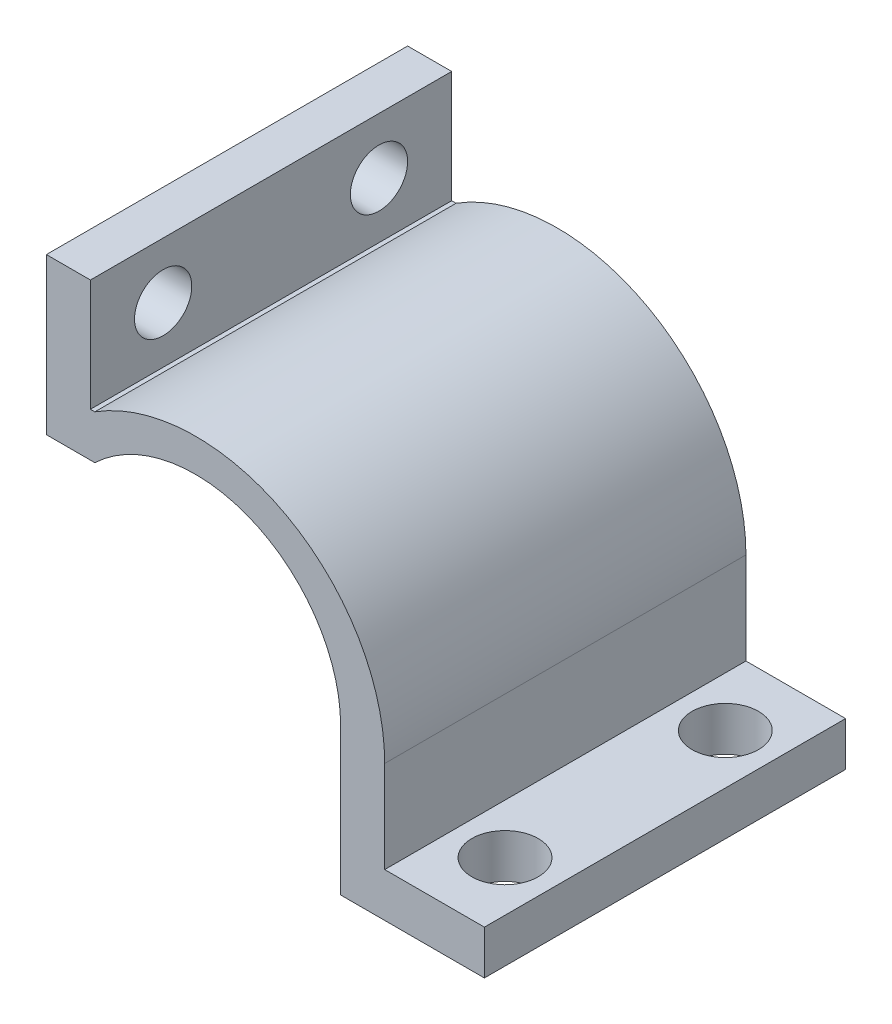
ISO-10303-21;
HEADER;
FILE_DESCRIPTION(('STEP AP214'),'2;1');
FILE_NAME('part.step','',(''),(''),'','','');
FILE_SCHEMA(('AUTOMOTIVE_DESIGN { 1 0 10303 214 1 1 1 1 }'));
ENDSEC;
DATA;
#1=APPLICATION_CONTEXT('core data for automotive mechanical design processes');
#2=APPLICATION_PROTOCOL_DEFINITION('international standard','automotive_design',2000,#1);
#3=PRODUCT_CONTEXT('',#1,'mechanical');
#4=PRODUCT('Part','Part','',(#3));
#5=PRODUCT_RELATED_PRODUCT_CATEGORY('part','',(#4));
#6=PRODUCT_DEFINITION_FORMATION('','',#4);
#7=PRODUCT_DEFINITION_CONTEXT('part definition',#1,'design');
#8=PRODUCT_DEFINITION('design','',#6,#7);
#9=PRODUCT_DEFINITION_SHAPE('','',#8);
#10=(LENGTH_UNIT() NAMED_UNIT(*) SI_UNIT(.MILLI.,.METRE.));
#11=(NAMED_UNIT(*) PLANE_ANGLE_UNIT() SI_UNIT($,.RADIAN.));
#12=(NAMED_UNIT(*) SI_UNIT($,.STERADIAN.) SOLID_ANGLE_UNIT());
#13=UNCERTAINTY_MEASURE_WITH_UNIT(LENGTH_MEASURE(1.E-05),#10,'distance_accuracy_value','');
#14=(GEOMETRIC_REPRESENTATION_CONTEXT(3) GLOBAL_UNCERTAINTY_ASSIGNED_CONTEXT((#13)) GLOBAL_UNIT_ASSIGNED_CONTEXT((#10,
#11,#12)) REPRESENTATION_CONTEXT('',''));
#15=CARTESIAN_POINT('',(0.,0.,0.));
#16=DIRECTION('',(0.,0.,1.));
#17=DIRECTION('',(1.,0.,0.));
#18=AXIS2_PLACEMENT_3D('',#15,#16,#17);
#19=CARTESIAN_POINT('',(65.6321081190194,-33.2279796622058,-82.));
#20=DIRECTION('',(1.,0.,0.));
#21=DIRECTION('',(0.,0.,-1.));
#22=AXIS2_PLACEMENT_3D('',#19,#20,#21);
#23=PLANE('',#22);
#24=DIRECTION('',(0.,1.,0.));
#25=VECTOR('',#24,1.);
#26=CARTESIAN_POINT('',(65.6321081190194,-33.2279796622058,0.));
#27=LINE('',#26,#25);
#28=CARTESIAN_POINT('',(65.6321081190194,-33.2279796622058,0.));
#29=VERTEX_POINT('',#28);
#30=CARTESIAN_POINT('',(65.6321081190194,-23.2279796622058,0.));
#31=VERTEX_POINT('',#30);
#32=EDGE_CURVE('E154',#29,#31,#27,.T.);
#33=ORIENTED_EDGE('',*,*,#32,.F.);
#34=DIRECTION('',(0.,0.,1.));
#35=VECTOR('',#34,1.);
#36=CARTESIAN_POINT('',(65.6321081190194,-33.2279796622058,-82.));
#37=LINE('',#36,#35);
#38=CARTESIAN_POINT('',(65.6321081190194,-33.2279796622058,-82.));
#39=VERTEX_POINT('',#38);
#40=EDGE_CURVE('E11',#39,#29,#37,.T.);
#41=ORIENTED_EDGE('',*,*,#40,.F.);
#42=DIRECTION('',(0.,1.,0.));
#43=VECTOR('',#42,1.);
#44=CARTESIAN_POINT('',(65.6321081190194,-33.2279796622058,-82.));
#45=LINE('',#44,#43);
#46=CARTESIAN_POINT('',(65.6321081190194,-23.2279796622058,-82.));
#47=VERTEX_POINT('',#46);
#48=EDGE_CURVE('E187',#39,#47,#45,.T.);
#49=ORIENTED_EDGE('',*,*,#48,.T.);
#50=DIRECTION('',(0.,0.,1.));
#51=VECTOR('',#50,1.);
#52=CARTESIAN_POINT('',(65.6321081190194,-23.2279796622058,-82.));
#53=LINE('',#52,#51);
#54=EDGE_CURVE('E36',#47,#31,#53,.T.);
#55=ORIENTED_EDGE('',*,*,#54,.T.);
#56=EDGE_LOOP('',(#33,#41,#49,#55));
#57=FACE_BOUND('',#56,.T.);
#58=ADVANCED_FACE('F33',(#57),#23,.T.);
#59=CARTESIAN_POINT('',(33.0033488121935,-33.2279796622058,-82.));
#60=DIRECTION('',(0.,-1.,0.));
#61=DIRECTION('',(1.,0.,0.));
#62=AXIS2_PLACEMENT_3D('',#59,#60,#61);
#63=PLANE('',#62);
#64=CARTESIAN_POINT('',(54.3177284656065,-33.2279796622058,-16.));
#65=DIRECTION('',(0.,1.,0.));
#66=DIRECTION('',(-1.,0.,0.));
#67=AXIS2_PLACEMENT_3D('',#64,#65,#66);
#68=CIRCLE('',#67,7.53747224511734);
#69=CARTESIAN_POINT('',(46.7802562204891,-33.2279796622058,-16.));
#70=VERTEX_POINT('',#69);
#71=EDGE_CURVE('E158',#70,#70,#68,.T.);
#72=ORIENTED_EDGE('',*,*,#71,.T.);
#73=EDGE_LOOP('',(#72));
#74=FACE_BOUND('',#73,.T.);
#75=CARTESIAN_POINT('',(54.3177284656065,-33.2279796622058,-66.));
#76=DIRECTION('',(0.,1.,0.));
#77=DIRECTION('',(-1.,0.,0.));
#78=AXIS2_PLACEMENT_3D('',#75,#76,#77);
#79=CIRCLE('',#78,7.53747224511734);
#80=CARTESIAN_POINT('',(46.7802562204891,-33.2279796622058,-66.));
#81=VERTEX_POINT('',#80);
#82=EDGE_CURVE('E263',#81,#81,#79,.T.);
#83=ORIENTED_EDGE('',*,*,#82,.T.);
#84=EDGE_LOOP('',(#83));
#85=FACE_BOUND('',#84,.T.);
#86=DIRECTION('',(1.,0.,0.));
#87=VECTOR('',#86,1.);
#88=CARTESIAN_POINT('',(33.0033488121935,-33.2279796622058,0.));
#89=LINE('',#88,#87);
#90=CARTESIAN_POINT('',(33.0033488121935,-33.2279796622058,0.));
#91=VERTEX_POINT('',#90);
#92=EDGE_CURVE('E185',#91,#29,#89,.T.);
#93=ORIENTED_EDGE('',*,*,#92,.F.);
#94=DIRECTION('',(0.,0.,1.));
#95=VECTOR('',#94,1.);
#96=CARTESIAN_POINT('',(33.0033488121935,-33.2279796622058,-82.));
#97=LINE('',#96,#95);
#98=CARTESIAN_POINT('',(33.0033488121935,-33.2279796622058,-82.));
#99=VERTEX_POINT('',#98);
#100=EDGE_CURVE('E42',#99,#91,#97,.T.);
#101=ORIENTED_EDGE('',*,*,#100,.F.);
#102=DIRECTION('',(1.,0.,0.));
#103=VECTOR('',#102,1.);
#104=CARTESIAN_POINT('',(33.0033488121935,-33.2279796622058,-82.));
#105=LINE('',#104,#103);
#106=EDGE_CURVE('E144',#99,#39,#105,.T.);
#107=ORIENTED_EDGE('',*,*,#106,.T.);
#108=ORIENTED_EDGE('',*,*,#40,.T.);
#109=EDGE_LOOP('',(#93,#101,#107,#108));
#110=FACE_BOUND('',#109,.T.);
#111=ADVANCED_FACE('F207',(#74,#85,#110),#63,.T.);
#112=CARTESIAN_POINT('',(33.0033488121935,0.,-82.));
#113=DIRECTION('',(-1.,0.,0.));
#114=DIRECTION('',(0.,-1.,0.));
#115=AXIS2_PLACEMENT_3D('',#112,#113,#114);
#116=PLANE('',#115);
#117=DIRECTION('',(0.,-1.,0.));
#118=VECTOR('',#117,1.);
#119=CARTESIAN_POINT('',(33.0033488121935,0.,0.));
#120=LINE('',#119,#118);
#121=CARTESIAN_POINT('',(33.0033488121935,0.,0.));
#122=VERTEX_POINT('',#121);
#123=EDGE_CURVE('E131',#122,#91,#120,.T.);
#124=ORIENTED_EDGE('',*,*,#123,.F.);
#125=DIRECTION('',(0.,0.,1.));
#126=VECTOR('',#125,1.);
#127=CARTESIAN_POINT('',(33.0033488121935,0.,-82.));
#128=LINE('',#127,#126);
#129=CARTESIAN_POINT('',(33.0033488121935,0.,-82.));
#130=VERTEX_POINT('',#129);
#131=EDGE_CURVE('E126',#130,#122,#128,.T.);
#132=ORIENTED_EDGE('',*,*,#131,.F.);
#133=DIRECTION('',(0.,-1.,0.));
#134=VECTOR('',#133,1.);
#135=CARTESIAN_POINT('',(33.0033488121935,0.,-82.));
#136=LINE('',#135,#134);
#137=EDGE_CURVE('E129',#130,#99,#136,.T.);
#138=ORIENTED_EDGE('',*,*,#137,.T.);
#139=ORIENTED_EDGE('',*,*,#100,.T.);
#140=EDGE_LOOP('',(#124,#132,#138,#139));
#141=FACE_BOUND('',#140,.T.);
#142=ADVANCED_FACE('F128',(#141),#116,.T.);
#143=CARTESIAN_POINT('',(0.00334881219352058,0.,-82.));
#144=DIRECTION('',(0.,0.,1.));
#145=DIRECTION('',(1.,0.,0.));
#146=AXIS2_PLACEMENT_3D('',#143,#144,#145);
#147=CYLINDRICAL_SURFACE('',#146,33.);
#148=CARTESIAN_POINT('',(0.00334881219352058,0.,0.));
#149=DIRECTION('',(0.,0.,-1.));
#150=DIRECTION('',(-1.,0.,0.));
#151=AXIS2_PLACEMENT_3D('',#148,#149,#150);
#152=CIRCLE('',#151,33.);
#153=CARTESIAN_POINT('',(-22.7938319066322,23.8597684664626,0.));
#154=VERTEX_POINT('',#153);
#155=EDGE_CURVE('E182',#154,#122,#152,.T.);
#156=ORIENTED_EDGE('',*,*,#155,.F.);
#157=DIRECTION('',(0.,0.,1.));
#158=VECTOR('',#157,1.);
#159=CARTESIAN_POINT('',(-22.7938319066322,23.8597684664626,-82.));
#160=LINE('',#159,#158);
#161=CARTESIAN_POINT('',(-22.7938319066322,23.8597684664626,-82.));
#162=VERTEX_POINT('',#161);
#163=EDGE_CURVE('E136',#162,#154,#160,.T.);
#164=ORIENTED_EDGE('',*,*,#163,.F.);
#165=CARTESIAN_POINT('',(0.00334881219352058,0.,-82.));
#166=DIRECTION('',(0.,0.,-1.));
#167=DIRECTION('',(-1.,0.,0.));
#168=AXIS2_PLACEMENT_3D('',#165,#166,#167);
#169=CIRCLE('',#168,33.);
#170=EDGE_CURVE('E142',#162,#130,#169,.T.);
#171=ORIENTED_EDGE('',*,*,#170,.T.);
#172=ORIENTED_EDGE('',*,*,#131,.T.);
#173=EDGE_LOOP('',(#156,#164,#171,#172));
#174=FACE_BOUND('',#173,.T.);
#175=ADVANCED_FACE('F146',(#174),#147,.F.);
#176=CARTESIAN_POINT('',(-22.7938319066322,23.8597684664626,-82.));
#177=DIRECTION('',(0.,-1.,0.));
#178=DIRECTION('',(1.,0.,0.));
#179=AXIS2_PLACEMENT_3D('',#176,#177,#178);
#180=PLANE('',#179);
#181=DIRECTION('',(1.,0.,0.));
#182=VECTOR('',#181,1.);
#183=CARTESIAN_POINT('',(-22.7938319066322,23.8597684664626,0.));
#184=LINE('',#183,#182);
#185=CARTESIAN_POINT('',(-33.7938319066322,23.8597684664626,0.));
#186=VERTEX_POINT('',#185);
#187=EDGE_CURVE('E179',#186,#154,#184,.T.);
#188=ORIENTED_EDGE('',*,*,#187,.F.);
#189=DIRECTION('',(0.,0.,1.));
#190=VECTOR('',#189,1.);
#191=CARTESIAN_POINT('',(-33.7938319066322,23.8597684664626,-82.));
#192=LINE('',#191,#190);
#193=CARTESIAN_POINT('',(-33.7938319066322,23.8597684664626,-82.));
#194=VERTEX_POINT('',#193);
#195=EDGE_CURVE('E191',#194,#186,#192,.T.);
#196=ORIENTED_EDGE('',*,*,#195,.F.);
#197=DIRECTION('',(1.,0.,0.));
#198=VECTOR('',#197,1.);
#199=CARTESIAN_POINT('',(-22.7938319066322,23.8597684664626,-82.));
#200=LINE('',#199,#198);
#201=EDGE_CURVE('E147',#194,#162,#200,.T.);
#202=ORIENTED_EDGE('',*,*,#201,.T.);
#203=ORIENTED_EDGE('',*,*,#163,.T.);
#204=EDGE_LOOP('',(#188,#196,#202,#203));
#205=FACE_BOUND('',#204,.T.);
#206=ADVANCED_FACE('F223',(#205),#180,.T.);
#207=CARTESIAN_POINT('',(-33.7938319066322,23.8597684664626,-82.));
#208=DIRECTION('',(-1.,0.,0.));
#209=DIRECTION('',(0.,-1.,0.));
#210=AXIS2_PLACEMENT_3D('',#207,#208,#209);
#211=PLANE('',#210);
#212=CARTESIAN_POINT('',(-33.7938319066322,46.5674580393195,-16.5));
#213=DIRECTION('',(1.,0.,0.));
#214=DIRECTION('',(0.,0.,-1.));
#215=AXIS2_PLACEMENT_3D('',#212,#213,#214);
#216=CIRCLE('',#215,6.5);
#217=CARTESIAN_POINT('',(-33.7938319066322,46.5674580393195,-23.));
#218=VERTEX_POINT('',#217);
#219=EDGE_CURVE('E264',#218,#218,#216,.T.);
#220=ORIENTED_EDGE('',*,*,#219,.T.);
#221=EDGE_LOOP('',(#220));
#222=FACE_BOUND('',#221,.T.);
#223=CARTESIAN_POINT('',(-33.7938319066322,46.5674580393195,-65.5));
#224=DIRECTION('',(1.,0.,0.));
#225=DIRECTION('',(0.,0.,-1.));
#226=AXIS2_PLACEMENT_3D('',#223,#224,#225);
#227=CIRCLE('',#226,6.5);
#228=CARTESIAN_POINT('',(-33.7938319066322,46.5674580393195,-72.));
#229=VERTEX_POINT('',#228);
#230=EDGE_CURVE('E310',#229,#229,#227,.T.);
#231=ORIENTED_EDGE('',*,*,#230,.T.);
#232=EDGE_LOOP('',(#231));
#233=FACE_BOUND('',#232,.T.);
#234=DIRECTION('',(0.,-1.,0.));
#235=VECTOR('',#234,1.);
#236=CARTESIAN_POINT('',(-33.7938319066322,23.8597684664626,0.));
#237=LINE('',#236,#235);
#238=CARTESIAN_POINT('',(-33.7938319066322,59.2751476121765,0.));
#239=VERTEX_POINT('',#238);
#240=EDGE_CURVE('E176',#239,#186,#237,.T.);
#241=ORIENTED_EDGE('',*,*,#240,.F.);
#242=DIRECTION('',(0.,0.,1.));
#243=VECTOR('',#242,1.);
#244=CARTESIAN_POINT('',(-33.7938319066322,59.2751476121765,-82.));
#245=LINE('',#244,#243);
#246=CARTESIAN_POINT('',(-33.7938319066322,59.2751476121765,-82.));
#247=VERTEX_POINT('',#246);
#248=EDGE_CURVE('E193',#247,#239,#245,.T.);
#249=ORIENTED_EDGE('',*,*,#248,.F.);
#250=DIRECTION('',(0.,-1.,0.));
#251=VECTOR('',#250,1.);
#252=CARTESIAN_POINT('',(-33.7938319066322,23.8597684664626,-82.));
#253=LINE('',#252,#251);
#254=EDGE_CURVE('E149',#247,#194,#253,.T.);
#255=ORIENTED_EDGE('',*,*,#254,.T.);
#256=ORIENTED_EDGE('',*,*,#195,.T.);
#257=EDGE_LOOP('',(#241,#249,#255,#256));
#258=FACE_BOUND('',#257,.T.);
#259=ADVANCED_FACE('F226',(#222,#233,#258),#211,.T.);
#260=CARTESIAN_POINT('',(-33.7938319066322,59.2751476121765,-82.));
#261=DIRECTION('',(0.,1.,0.));
#262=DIRECTION('',(0.,0.,1.));
#263=AXIS2_PLACEMENT_3D('',#260,#261,#262);
#264=PLANE('',#263);
#265=DIRECTION('',(-1.,0.,0.));
#266=VECTOR('',#265,1.);
#267=CARTESIAN_POINT('',(-33.7938319066322,59.2751476121765,0.));
#268=LINE('',#267,#266);
#269=CARTESIAN_POINT('',(-23.7938319066322,59.2751476121765,0.));
#270=VERTEX_POINT('',#269);
#271=EDGE_CURVE('E173',#270,#239,#268,.T.);
#272=ORIENTED_EDGE('',*,*,#271,.F.);
#273=DIRECTION('',(0.,0.,1.));
#274=VECTOR('',#273,1.);
#275=CARTESIAN_POINT('',(-23.7938319066322,59.2751476121765,-82.));
#276=LINE('',#275,#274);
#277=CARTESIAN_POINT('',(-23.7938319066322,59.2751476121765,-82.));
#278=VERTEX_POINT('',#277);
#279=EDGE_CURVE('E195',#278,#270,#276,.T.);
#280=ORIENTED_EDGE('',*,*,#279,.F.);
#281=DIRECTION('',(-1.,0.,0.));
#282=VECTOR('',#281,1.);
#283=CARTESIAN_POINT('',(-33.7938319066322,59.2751476121765,-82.));
#284=LINE('',#283,#282);
#285=EDGE_CURVE('E288',#278,#247,#284,.T.);
#286=ORIENTED_EDGE('',*,*,#285,.T.);
#287=ORIENTED_EDGE('',*,*,#248,.T.);
#288=EDGE_LOOP('',(#272,#280,#286,#287));
#289=FACE_BOUND('',#288,.T.);
#290=ADVANCED_FACE('F230',(#289),#264,.T.);
#291=CARTESIAN_POINT('',(-23.7938319066322,59.2751476121765,-82.));
#292=DIRECTION('',(1.,0.,0.));
#293=DIRECTION('',(0.,1.,0.));
#294=AXIS2_PLACEMENT_3D('',#291,#292,#293);
#295=PLANE('',#294);
#296=CARTESIAN_POINT('',(-23.7938319066322,46.5674580393195,-16.5));
#297=DIRECTION('',(1.,0.,0.));
#298=DIRECTION('',(0.,0.,-1.));
#299=AXIS2_PLACEMENT_3D('',#296,#297,#298);
#300=CIRCLE('',#299,6.5);
#301=CARTESIAN_POINT('',(-23.7938319066322,46.5674580393195,-23.));
#302=VERTEX_POINT('',#301);
#303=EDGE_CURVE('E269',#302,#302,#300,.T.);
#304=ORIENTED_EDGE('',*,*,#303,.F.);
#305=EDGE_LOOP('',(#304));
#306=FACE_BOUND('',#305,.T.);
#307=CARTESIAN_POINT('',(-23.7938319066322,46.5674580393195,-65.5));
#308=DIRECTION('',(1.,0.,0.));
#309=DIRECTION('',(0.,0.,-1.));
#310=AXIS2_PLACEMENT_3D('',#307,#308,#309);
#311=CIRCLE('',#310,6.5);
#312=CARTESIAN_POINT('',(-23.7938319066322,46.5674580393195,-72.));
#313=VERTEX_POINT('',#312);
#314=EDGE_CURVE('E307',#313,#313,#311,.T.);
#315=ORIENTED_EDGE('',*,*,#314,.F.);
#316=EDGE_LOOP('',(#315));
#317=FACE_BOUND('',#316,.T.);
#318=DIRECTION('',(0.,1.,0.));
#319=VECTOR('',#318,1.);
#320=CARTESIAN_POINT('',(-23.7938319066322,59.2751476121765,0.));
#321=LINE('',#320,#319);
#322=CARTESIAN_POINT('',(-23.7938319066322,33.8597684664626,0.));
#323=VERTEX_POINT('',#322);
#324=EDGE_CURVE('E170',#323,#270,#321,.T.);
#325=ORIENTED_EDGE('',*,*,#324,.F.);
#326=DIRECTION('',(0.,0.,1.));
#327=VECTOR('',#326,1.);
#328=CARTESIAN_POINT('',(-23.7938319066322,33.8597684664626,-82.));
#329=LINE('',#328,#327);
#330=CARTESIAN_POINT('',(-23.7938319066322,33.8597684664626,-82.));
#331=VERTEX_POINT('',#330);
#332=EDGE_CURVE('E197',#331,#323,#329,.T.);
#333=ORIENTED_EDGE('',*,*,#332,.F.);
#334=DIRECTION('',(0.,1.,0.));
#335=VECTOR('',#334,1.);
#336=CARTESIAN_POINT('',(-23.7938319066322,59.2751476121765,-82.));
#337=LINE('',#336,#335);
#338=EDGE_CURVE('E285',#331,#278,#337,.T.);
#339=ORIENTED_EDGE('',*,*,#338,.T.);
#340=ORIENTED_EDGE('',*,*,#279,.T.);
#341=EDGE_LOOP('',(#325,#333,#339,#340));
#342=FACE_BOUND('',#341,.T.);
#343=ADVANCED_FACE('F234',(#306,#317,#342),#295,.T.);
#344=CARTESIAN_POINT('',(-23.7938319066322,33.8597684664626,-82.));
#345=DIRECTION('',(0.,1.,0.));
#346=DIRECTION('',(0.,0.,1.));
#347=AXIS2_PLACEMENT_3D('',#344,#345,#346);
#348=PLANE('',#347);
#349=DIRECTION('',(-1.,0.,0.));
#350=VECTOR('',#349,1.);
#351=CARTESIAN_POINT('',(-23.7938319066322,33.8597684664626,0.));
#352=LINE('',#351,#350);
#353=CARTESIAN_POINT('',(-22.7938319066322,33.8597684664626,0.));
#354=VERTEX_POINT('',#353);
#355=EDGE_CURVE('E167',#354,#323,#352,.T.);
#356=ORIENTED_EDGE('',*,*,#355,.F.);
#357=DIRECTION('',(0.,0.,1.));
#358=VECTOR('',#357,1.);
#359=CARTESIAN_POINT('',(-22.7938319066322,33.8597684664626,-82.));
#360=LINE('',#359,#358);
#361=CARTESIAN_POINT('',(-22.7938319066322,33.8597684664626,-82.));
#362=VERTEX_POINT('',#361);
#363=EDGE_CURVE('E199',#362,#354,#360,.T.);
#364=ORIENTED_EDGE('',*,*,#363,.F.);
#365=DIRECTION('',(-1.,0.,0.));
#366=VECTOR('',#365,1.);
#367=CARTESIAN_POINT('',(-23.7938319066322,33.8597684664626,-82.));
#368=LINE('',#367,#366);
#369=EDGE_CURVE('E282',#362,#331,#368,.T.);
#370=ORIENTED_EDGE('',*,*,#369,.T.);
#371=ORIENTED_EDGE('',*,*,#332,.T.);
#372=EDGE_LOOP('',(#356,#364,#370,#371));
#373=FACE_BOUND('',#372,.T.);
#374=ADVANCED_FACE('F238',(#373),#348,.T.);
#375=CARTESIAN_POINT('',(0.130433193147299,-2.36956996681399,-82.));
#376=DIRECTION('',(0.,0.,1.));
#377=DIRECTION('',(1.,0.,0.));
#378=AXIS2_PLACEMENT_3D('',#375,#376,#377);
#379=CYLINDRICAL_SURFACE('',#378,42.8729156190462);
#380=CARTESIAN_POINT('',(0.130433193147299,-2.36956996681399,0.));
#381=DIRECTION('',(0.,0.,1.));
#382=DIRECTION('',(-1.,0.,0.));
#383=AXIS2_PLACEMENT_3D('',#380,#381,#382);
#384=CIRCLE('',#383,42.8729156190462);
#385=CARTESIAN_POINT('',(43.0033488121935,-2.36956996681399,0.));
#386=VERTEX_POINT('',#385);
#387=EDGE_CURVE('E164',#386,#354,#384,.T.);
#388=ORIENTED_EDGE('',*,*,#387,.F.);
#389=DIRECTION('',(0.,0.,1.));
#390=VECTOR('',#389,1.);
#391=CARTESIAN_POINT('',(43.0033488121935,-2.36956996681399,-82.));
#392=LINE('',#391,#390);
#393=CARTESIAN_POINT('',(43.0033488121935,-2.36956996681399,-82.));
#394=VERTEX_POINT('',#393);
#395=EDGE_CURVE('E201',#394,#386,#392,.T.);
#396=ORIENTED_EDGE('',*,*,#395,.F.);
#397=CARTESIAN_POINT('',(0.130433193147299,-2.36956996681399,-82.));
#398=DIRECTION('',(0.,0.,1.));
#399=DIRECTION('',(-1.,0.,0.));
#400=AXIS2_PLACEMENT_3D('',#397,#398,#399);
#401=CIRCLE('',#400,42.8729156190462);
#402=EDGE_CURVE('E279',#394,#362,#401,.T.);
#403=ORIENTED_EDGE('',*,*,#402,.T.);
#404=ORIENTED_EDGE('',*,*,#363,.T.);
#405=EDGE_LOOP('',(#388,#396,#403,#404));
#406=FACE_BOUND('',#405,.T.);
#407=ADVANCED_FACE('F242',(#406),#379,.T.);
#408=CARTESIAN_POINT('',(43.0033488121935,-23.2279796622058,-82.));
#409=DIRECTION('',(1.,0.,0.));
#410=DIRECTION('',(0.,0.,-1.));
#411=AXIS2_PLACEMENT_3D('',#408,#409,#410);
#412=PLANE('',#411);
#413=DIRECTION('',(0.,1.,0.));
#414=VECTOR('',#413,1.);
#415=CARTESIAN_POINT('',(43.0033488121935,-23.2279796622058,0.));
#416=LINE('',#415,#414);
#417=CARTESIAN_POINT('',(43.0033488121935,-23.2279796622058,0.));
#418=VERTEX_POINT('',#417);
#419=EDGE_CURVE('E161',#418,#386,#416,.T.);
#420=ORIENTED_EDGE('',*,*,#419,.F.);
#421=DIRECTION('',(0.,0.,1.));
#422=VECTOR('',#421,1.);
#423=CARTESIAN_POINT('',(43.0033488121935,-23.2279796622058,-82.));
#424=LINE('',#423,#422);
#425=CARTESIAN_POINT('',(43.0033488121935,-23.2279796622058,-82.));
#426=VERTEX_POINT('',#425);
#427=EDGE_CURVE('E202',#426,#418,#424,.T.);
#428=ORIENTED_EDGE('',*,*,#427,.F.);
#429=DIRECTION('',(0.,1.,0.));
#430=VECTOR('',#429,1.);
#431=CARTESIAN_POINT('',(43.0033488121935,-23.2279796622058,-82.));
#432=LINE('',#431,#430);
#433=EDGE_CURVE('E276',#426,#394,#432,.T.);
#434=ORIENTED_EDGE('',*,*,#433,.T.);
#435=ORIENTED_EDGE('',*,*,#395,.T.);
#436=EDGE_LOOP('',(#420,#428,#434,#435));
#437=FACE_BOUND('',#436,.T.);
#438=ADVANCED_FACE('F246',(#437),#412,.T.);
#439=CARTESIAN_POINT('',(65.6321081190194,-23.2279796622058,-82.));
#440=DIRECTION('',(0.,1.,0.));
#441=DIRECTION('',(-1.,0.,0.));
#442=AXIS2_PLACEMENT_3D('',#439,#440,#441);
#443=PLANE('',#442);
#444=CARTESIAN_POINT('',(54.3177284656065,-23.2279796622058,-16.));
#445=DIRECTION('',(0.,1.,0.));
#446=DIRECTION('',(-1.,0.,0.));
#447=AXIS2_PLACEMENT_3D('',#444,#445,#446);
#448=CIRCLE('',#447,7.53747224511734);
#449=CARTESIAN_POINT('',(46.7802562204891,-23.2279796622058,-16.));
#450=VERTEX_POINT('',#449);
#451=EDGE_CURVE('E258',#450,#450,#448,.T.);
#452=ORIENTED_EDGE('',*,*,#451,.F.);
#453=EDGE_LOOP('',(#452));
#454=FACE_BOUND('',#453,.T.);
#455=CARTESIAN_POINT('',(54.3177284656065,-23.2279796622058,-66.));
#456=DIRECTION('',(0.,1.,0.));
#457=DIRECTION('',(-1.,0.,0.));
#458=AXIS2_PLACEMENT_3D('',#455,#456,#457);
#459=CIRCLE('',#458,7.53747224511734);
#460=CARTESIAN_POINT('',(46.7802562204891,-23.2279796622058,-66.));
#461=VERTEX_POINT('',#460);
#462=EDGE_CURVE('E261',#461,#461,#459,.T.);
#463=ORIENTED_EDGE('',*,*,#462,.F.);
#464=EDGE_LOOP('',(#463));
#465=FACE_BOUND('',#464,.T.);
#466=DIRECTION('',(-1.,0.,0.));
#467=VECTOR('',#466,1.);
#468=CARTESIAN_POINT('',(65.6321081190194,-23.2279796622058,0.));
#469=LINE('',#468,#467);
#470=EDGE_CURVE('E157',#31,#418,#469,.T.);
#471=ORIENTED_EDGE('',*,*,#470,.F.);
#472=ORIENTED_EDGE('',*,*,#54,.F.);
#473=DIRECTION('',(-1.,0.,0.));
#474=VECTOR('',#473,1.);
#475=CARTESIAN_POINT('',(65.6321081190194,-23.2279796622058,-82.));
#476=LINE('',#475,#474);
#477=EDGE_CURVE('E274',#47,#426,#476,.T.);
#478=ORIENTED_EDGE('',*,*,#477,.T.);
#479=ORIENTED_EDGE('',*,*,#427,.T.);
#480=EDGE_LOOP('',(#471,#472,#478,#479));
#481=FACE_BOUND('',#480,.T.);
#482=ADVANCED_FACE('F204',(#454,#465,#481),#443,.T.);
#483=CARTESIAN_POINT('',(0.130433193147299,-2.36956996681399,-82.));
#484=DIRECTION('',(0.,0.,-1.));
#485=DIRECTION('',(-1.,0.,0.));
#486=AXIS2_PLACEMENT_3D('',#483,#484,#485);
#487=PLANE('',#486);
#488=ORIENTED_EDGE('',*,*,#48,.F.);
#489=ORIENTED_EDGE('',*,*,#106,.F.);
#490=ORIENTED_EDGE('',*,*,#137,.F.);
#491=ORIENTED_EDGE('',*,*,#170,.F.);
#492=ORIENTED_EDGE('',*,*,#201,.F.);
#493=ORIENTED_EDGE('',*,*,#254,.F.);
#494=ORIENTED_EDGE('',*,*,#285,.F.);
#495=ORIENTED_EDGE('',*,*,#338,.F.);
#496=ORIENTED_EDGE('',*,*,#369,.F.);
#497=ORIENTED_EDGE('',*,*,#402,.F.);
#498=ORIENTED_EDGE('',*,*,#433,.F.);
#499=ORIENTED_EDGE('',*,*,#477,.F.);
#500=EDGE_LOOP('',(#488,#489,#490,#491,#492,#493,#494,#495,#496,#497,#498,#499));
#501=FACE_BOUND('',#500,.T.);
#502=ADVANCED_FACE('F140',(#501),#487,.T.);
#503=CARTESIAN_POINT('',(0.130433193147299,-2.36956996681399,0.));
#504=DIRECTION('',(0.,0.,-1.));
#505=DIRECTION('',(-1.,0.,0.));
#506=AXIS2_PLACEMENT_3D('',#503,#504,#505);
#507=PLANE('',#506);
#508=ORIENTED_EDGE('',*,*,#32,.T.);
#509=ORIENTED_EDGE('',*,*,#470,.T.);
#510=ORIENTED_EDGE('',*,*,#419,.T.);
#511=ORIENTED_EDGE('',*,*,#387,.T.);
#512=ORIENTED_EDGE('',*,*,#355,.T.);
#513=ORIENTED_EDGE('',*,*,#324,.T.);
#514=ORIENTED_EDGE('',*,*,#271,.T.);
#515=ORIENTED_EDGE('',*,*,#240,.T.);
#516=ORIENTED_EDGE('',*,*,#187,.T.);
#517=ORIENTED_EDGE('',*,*,#155,.T.);
#518=ORIENTED_EDGE('',*,*,#123,.T.);
#519=ORIENTED_EDGE('',*,*,#92,.T.);
#520=EDGE_LOOP('',(#508,#509,#510,#511,#512,#513,#514,#515,#516,#517,#518,#519));
#521=FACE_BOUND('',#520,.T.);
#522=ADVANCED_FACE('F206',(#521),#507,.F.);
#523=CARTESIAN_POINT('',(54.3177284656065,-33.2279796622058,-66.));
#524=DIRECTION('',(0.,1.,0.));
#525=DIRECTION('',(-1.,0.,0.));
#526=AXIS2_PLACEMENT_3D('',#523,#524,#525);
#527=CYLINDRICAL_SURFACE('',#526,7.53747224511734);
#528=ORIENTED_EDGE('',*,*,#82,.F.);
#529=EDGE_LOOP('',(#528));
#530=FACE_BOUND('',#529,.T.);
#531=ORIENTED_EDGE('',*,*,#462,.T.);
#532=EDGE_LOOP('',(#531));
#533=FACE_BOUND('',#532,.T.);
#534=ADVANCED_FACE('F331',(#530,#533),#527,.F.);
#535=CARTESIAN_POINT('',(54.3177284656065,-33.2279796622058,-16.));
#536=DIRECTION('',(0.,1.,0.));
#537=DIRECTION('',(-1.,0.,0.));
#538=AXIS2_PLACEMENT_3D('',#535,#536,#537);
#539=CYLINDRICAL_SURFACE('',#538,7.53747224511734);
#540=ORIENTED_EDGE('',*,*,#71,.F.);
#541=EDGE_LOOP('',(#540));
#542=FACE_BOUND('',#541,.T.);
#543=ORIENTED_EDGE('',*,*,#451,.T.);
#544=EDGE_LOOP('',(#543));
#545=FACE_BOUND('',#544,.T.);
#546=ADVANCED_FACE('F322',(#542,#545),#539,.F.);
#547=CARTESIAN_POINT('',(-33.7938319066322,46.5674580393195,-65.5));
#548=DIRECTION('',(1.,0.,0.));
#549=DIRECTION('',(0.,0.,-1.));
#550=AXIS2_PLACEMENT_3D('',#547,#548,#549);
#551=CYLINDRICAL_SURFACE('',#550,6.5);
#552=ORIENTED_EDGE('',*,*,#230,.F.);
#553=EDGE_LOOP('',(#552));
#554=FACE_BOUND('',#553,.T.);
#555=ORIENTED_EDGE('',*,*,#314,.T.);
#556=EDGE_LOOP('',(#555));
#557=FACE_BOUND('',#556,.T.);
#558=ADVANCED_FACE('F320',(#554,#557),#551,.F.);
#559=CARTESIAN_POINT('',(-33.7938319066322,46.5674580393195,-16.5));
#560=DIRECTION('',(1.,0.,0.));
#561=DIRECTION('',(0.,0.,-1.));
#562=AXIS2_PLACEMENT_3D('',#559,#560,#561);
#563=CYLINDRICAL_SURFACE('',#562,6.5);
#564=ORIENTED_EDGE('',*,*,#219,.F.);
#565=EDGE_LOOP('',(#564));
#566=FACE_BOUND('',#565,.T.);
#567=ORIENTED_EDGE('',*,*,#303,.T.);
#568=EDGE_LOOP('',(#567));
#569=FACE_BOUND('',#568,.T.);
#570=ADVANCED_FACE('F316',(#566,#569),#563,.F.);
#571=CLOSED_SHELL('',(#58,#111,#142,#175,#206,#259,#290,#343,#374,#407,#438,#482,#502,#522,#534,
#546,#558,#570));
#572=MANIFOLD_SOLID_BREP('B2',#571);
#573=ADVANCED_BREP_SHAPE_REPRESENTATION('',(#18,#572),#14);
#574=SHAPE_DEFINITION_REPRESENTATION(#9,#573);
ENDSEC;
END-ISO-10303-21;
